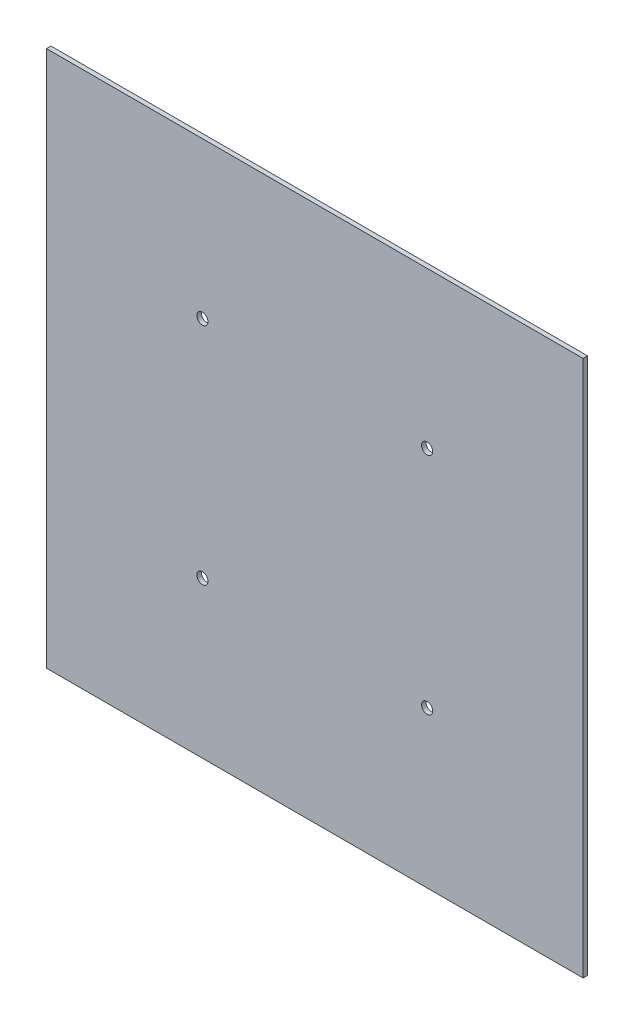
ISO-10303-21;
HEADER;
FILE_DESCRIPTION(('STEP AP214'),'2;1');
FILE_NAME('part.step','',(''),(''),'','','');
FILE_SCHEMA(('AUTOMOTIVE_DESIGN { 1 0 10303 214 1 1 1 1 }'));
ENDSEC;
DATA;
#1=APPLICATION_CONTEXT('core data for automotive mechanical design processes');
#2=APPLICATION_PROTOCOL_DEFINITION('international standard','automotive_design',2000,#1);
#3=PRODUCT_CONTEXT('',#1,'mechanical');
#4=PRODUCT('Part','Part','',(#3));
#5=PRODUCT_RELATED_PRODUCT_CATEGORY('part','',(#4));
#6=PRODUCT_DEFINITION_FORMATION('','',#4);
#7=PRODUCT_DEFINITION_CONTEXT('part definition',#1,'design');
#8=PRODUCT_DEFINITION('design','',#6,#7);
#9=PRODUCT_DEFINITION_SHAPE('','',#8);
#10=(LENGTH_UNIT() NAMED_UNIT(*) SI_UNIT(.MILLI.,.METRE.));
#11=(NAMED_UNIT(*) PLANE_ANGLE_UNIT() SI_UNIT($,.RADIAN.));
#12=(NAMED_UNIT(*) SI_UNIT($,.STERADIAN.) SOLID_ANGLE_UNIT());
#13=UNCERTAINTY_MEASURE_WITH_UNIT(LENGTH_MEASURE(1.E-05),#10,'distance_accuracy_value','');
#14=(GEOMETRIC_REPRESENTATION_CONTEXT(3) GLOBAL_UNCERTAINTY_ASSIGNED_CONTEXT((#13)) GLOBAL_UNIT_ASSIGNED_CONTEXT((#10,
#11,#12)) REPRESENTATION_CONTEXT('',''));
#15=CARTESIAN_POINT('',(0.,0.,0.));
#16=DIRECTION('',(0.,0.,1.));
#17=DIRECTION('',(1.,0.,0.));
#18=AXIS2_PLACEMENT_3D('',#15,#16,#17);
#19=CARTESIAN_POINT('',(0.,0.,2.54));
#20=DIRECTION('',(0.,0.,-1.));
#21=DIRECTION('',(-1.,0.,0.));
#22=AXIS2_PLACEMENT_3D('',#19,#20,#21);
#23=PLANE('',#22);
#24=CARTESIAN_POINT('',(216.225,88.5750000000001,2.54));
#25=DIRECTION('',(0.,0.,1.));
#26=DIRECTION('',(1.,0.,0.));
#27=AXIS2_PLACEMENT_3D('',#24,#25,#26);
#28=CIRCLE('',#27,3.175);
#29=CARTESIAN_POINT('',(219.4,88.5750000000001,2.54));
#30=VERTEX_POINT('',#29);
#31=EDGE_CURVE('E123',#30,#30,#28,.T.);
#32=ORIENTED_EDGE('',*,*,#31,.F.);
#33=EDGE_LOOP('',(#32));
#34=FACE_BOUND('',#33,.T.);
#35=CARTESIAN_POINT('',(88.575,216.225,2.54));
#36=DIRECTION('',(0.,0.,1.));
#37=DIRECTION('',(1.,0.,0.));
#38=AXIS2_PLACEMENT_3D('',#35,#36,#37);
#39=CIRCLE('',#38,3.175);
#40=CARTESIAN_POINT('',(91.75,216.225,2.54));
#41=VERTEX_POINT('',#40);
#42=EDGE_CURVE('E102',#41,#41,#39,.T.);
#43=ORIENTED_EDGE('',*,*,#42,.F.);
#44=EDGE_LOOP('',(#43));
#45=FACE_BOUND('',#44,.T.);
#46=DIRECTION('',(0.,-1.,0.));
#47=VECTOR('',#46,1.);
#48=CARTESIAN_POINT('',(0.,0.,2.54));
#49=LINE('',#48,#47);
#50=CARTESIAN_POINT('',(0.,304.8,2.54));
#51=VERTEX_POINT('',#50);
#52=CARTESIAN_POINT('',(0.,0.,2.54));
#53=VERTEX_POINT('',#52);
#54=EDGE_CURVE('E87',#51,#53,#49,.T.);
#55=ORIENTED_EDGE('',*,*,#54,.T.);
#56=DIRECTION('',(1.,0.,0.));
#57=VECTOR('',#56,1.);
#58=CARTESIAN_POINT('',(0.,0.,2.54));
#59=LINE('',#58,#57);
#60=CARTESIAN_POINT('',(304.8,0.,2.54));
#61=VERTEX_POINT('',#60);
#62=EDGE_CURVE('E82',#53,#61,#59,.T.);
#63=ORIENTED_EDGE('',*,*,#62,.T.);
#64=DIRECTION('',(0.,1.,0.));
#65=VECTOR('',#64,1.);
#66=CARTESIAN_POINT('',(304.8,0.,2.54));
#67=LINE('',#66,#65);
#68=CARTESIAN_POINT('',(304.8,304.8,2.54));
#69=VERTEX_POINT('',#68);
#70=EDGE_CURVE('E85',#61,#69,#67,.T.);
#71=ORIENTED_EDGE('',*,*,#70,.T.);
#72=DIRECTION('',(-1.,0.,0.));
#73=VECTOR('',#72,1.);
#74=CARTESIAN_POINT('',(0.,304.8,2.54));
#75=LINE('',#74,#73);
#76=EDGE_CURVE('E52',#69,#51,#75,.T.);
#77=ORIENTED_EDGE('',*,*,#76,.T.);
#78=EDGE_LOOP('',(#55,#63,#71,#77));
#79=FACE_BOUND('',#78,.T.);
#80=CARTESIAN_POINT('',(88.5750000000001,88.575,2.54));
#81=DIRECTION('',(0.,0.,1.));
#82=DIRECTION('',(-1.,0.,0.));
#83=AXIS2_PLACEMENT_3D('',#80,#81,#82);
#84=CIRCLE('',#83,3.175);
#85=CARTESIAN_POINT('',(85.4000000000001,88.575,2.54));
#86=VERTEX_POINT('',#85);
#87=EDGE_CURVE('E117',#86,#86,#84,.T.);
#88=ORIENTED_EDGE('',*,*,#87,.F.);
#89=EDGE_LOOP('',(#88));
#90=FACE_BOUND('',#89,.T.);
#91=CARTESIAN_POINT('',(216.225,216.225,2.54));
#92=DIRECTION('',(0.,0.,1.));
#93=DIRECTION('',(-1.,0.,0.));
#94=AXIS2_PLACEMENT_3D('',#91,#92,#93);
#95=CIRCLE('',#94,3.175);
#96=CARTESIAN_POINT('',(213.05,216.225,2.54));
#97=VERTEX_POINT('',#96);
#98=EDGE_CURVE('E129',#97,#97,#95,.T.);
#99=ORIENTED_EDGE('',*,*,#98,.F.);
#100=EDGE_LOOP('',(#99));
#101=FACE_BOUND('',#100,.T.);
#102=ADVANCED_FACE('F35',(#34,#45,#79,#90,#101),#23,.F.);
#103=CARTESIAN_POINT('',(0.,0.,0.));
#104=DIRECTION('',(0.,0.,-1.));
#105=DIRECTION('',(-1.,0.,0.));
#106=AXIS2_PLACEMENT_3D('',#103,#104,#105);
#107=PLANE('',#106);
#108=CARTESIAN_POINT('',(216.225,88.5750000000001,0.));
#109=DIRECTION('',(0.,0.,1.));
#110=DIRECTION('',(1.,0.,0.));
#111=AXIS2_PLACEMENT_3D('',#108,#109,#110);
#112=CIRCLE('',#111,3.175);
#113=CARTESIAN_POINT('',(219.4,88.5750000000001,0.));
#114=VERTEX_POINT('',#113);
#115=EDGE_CURVE('E126',#114,#114,#112,.T.);
#116=ORIENTED_EDGE('',*,*,#115,.T.);
#117=EDGE_LOOP('',(#116));
#118=FACE_BOUND('',#117,.T.);
#119=CARTESIAN_POINT('',(88.575,216.225,0.));
#120=DIRECTION('',(0.,0.,1.));
#121=DIRECTION('',(1.,0.,0.));
#122=AXIS2_PLACEMENT_3D('',#119,#120,#121);
#123=CIRCLE('',#122,3.175);
#124=CARTESIAN_POINT('',(91.75,216.225,0.));
#125=VERTEX_POINT('',#124);
#126=EDGE_CURVE('E114',#125,#125,#123,.T.);
#127=ORIENTED_EDGE('',*,*,#126,.T.);
#128=EDGE_LOOP('',(#127));
#129=FACE_BOUND('',#128,.T.);
#130=DIRECTION('',(0.,-1.,0.));
#131=VECTOR('',#130,1.);
#132=CARTESIAN_POINT('',(0.,0.,0.));
#133=LINE('',#132,#131);
#134=CARTESIAN_POINT('',(0.,304.8,0.));
#135=VERTEX_POINT('',#134);
#136=CARTESIAN_POINT('',(0.,0.,0.));
#137=VERTEX_POINT('',#136);
#138=EDGE_CURVE('E99',#135,#137,#133,.T.);
#139=ORIENTED_EDGE('',*,*,#138,.F.);
#140=DIRECTION('',(-1.,0.,0.));
#141=VECTOR('',#140,1.);
#142=CARTESIAN_POINT('',(0.,304.8,0.));
#143=LINE('',#142,#141);
#144=CARTESIAN_POINT('',(304.8,304.8,0.));
#145=VERTEX_POINT('',#144);
#146=EDGE_CURVE('E75',#145,#135,#143,.T.);
#147=ORIENTED_EDGE('',*,*,#146,.F.);
#148=DIRECTION('',(0.,1.,0.));
#149=VECTOR('',#148,1.);
#150=CARTESIAN_POINT('',(304.8,0.,0.));
#151=LINE('',#150,#149);
#152=CARTESIAN_POINT('',(304.8,0.,0.));
#153=VERTEX_POINT('',#152);
#154=EDGE_CURVE('E69',#153,#145,#151,.T.);
#155=ORIENTED_EDGE('',*,*,#154,.F.);
#156=DIRECTION('',(1.,0.,0.));
#157=VECTOR('',#156,1.);
#158=CARTESIAN_POINT('',(0.,0.,0.));
#159=LINE('',#158,#157);
#160=EDGE_CURVE('E91',#137,#153,#159,.T.);
#161=ORIENTED_EDGE('',*,*,#160,.F.);
#162=EDGE_LOOP('',(#139,#147,#155,#161));
#163=FACE_BOUND('',#162,.T.);
#164=CARTESIAN_POINT('',(88.5750000000001,88.575,0.));
#165=DIRECTION('',(0.,0.,1.));
#166=DIRECTION('',(-1.,0.,0.));
#167=AXIS2_PLACEMENT_3D('',#164,#165,#166);
#168=CIRCLE('',#167,3.175);
#169=CARTESIAN_POINT('',(85.4000000000001,88.575,0.));
#170=VERTEX_POINT('',#169);
#171=EDGE_CURVE('E120',#170,#170,#168,.T.);
#172=ORIENTED_EDGE('',*,*,#171,.T.);
#173=EDGE_LOOP('',(#172));
#174=FACE_BOUND('',#173,.T.);
#175=CARTESIAN_POINT('',(216.225,216.225,0.));
#176=DIRECTION('',(0.,0.,1.));
#177=DIRECTION('',(-1.,0.,0.));
#178=AXIS2_PLACEMENT_3D('',#175,#176,#177);
#179=CIRCLE('',#178,3.175);
#180=CARTESIAN_POINT('',(213.05,216.225,0.));
#181=VERTEX_POINT('',#180);
#182=EDGE_CURVE('E132',#181,#181,#179,.T.);
#183=ORIENTED_EDGE('',*,*,#182,.T.);
#184=EDGE_LOOP('',(#183));
#185=FACE_BOUND('',#184,.T.);
#186=ADVANCED_FACE('F110',(#118,#129,#163,#174,#185),#107,.T.);
#187=CARTESIAN_POINT('',(0.,0.,2.54));
#188=DIRECTION('',(1.,0.,0.));
#189=DIRECTION('',(0.,0.,-1.));
#190=AXIS2_PLACEMENT_3D('',#187,#188,#189);
#191=PLANE('',#190);
#192=ORIENTED_EDGE('',*,*,#138,.T.);
#193=DIRECTION('',(0.,0.,-1.));
#194=VECTOR('',#193,1.);
#195=CARTESIAN_POINT('',(0.,0.,2.54));
#196=LINE('',#195,#194);
#197=EDGE_CURVE('E11',#53,#137,#196,.T.);
#198=ORIENTED_EDGE('',*,*,#197,.F.);
#199=ORIENTED_EDGE('',*,*,#54,.F.);
#200=DIRECTION('',(0.,0.,-1.));
#201=VECTOR('',#200,1.);
#202=CARTESIAN_POINT('',(0.,304.8,2.54));
#203=LINE('',#202,#201);
#204=EDGE_CURVE('E95',#51,#135,#203,.T.);
#205=ORIENTED_EDGE('',*,*,#204,.T.);
#206=EDGE_LOOP('',(#192,#198,#199,#205));
#207=FACE_BOUND('',#206,.T.);
#208=ADVANCED_FACE('F37',(#207),#191,.F.);
#209=CARTESIAN_POINT('',(0.,0.,2.54));
#210=DIRECTION('',(0.,1.,0.));
#211=DIRECTION('',(0.,0.,1.));
#212=AXIS2_PLACEMENT_3D('',#209,#210,#211);
#213=PLANE('',#212);
#214=ORIENTED_EDGE('',*,*,#160,.T.);
#215=DIRECTION('',(0.,0.,-1.));
#216=VECTOR('',#215,1.);
#217=CARTESIAN_POINT('',(304.8,0.,2.54));
#218=LINE('',#217,#216);
#219=EDGE_CURVE('E44',#61,#153,#218,.T.);
#220=ORIENTED_EDGE('',*,*,#219,.F.);
#221=ORIENTED_EDGE('',*,*,#62,.F.);
#222=ORIENTED_EDGE('',*,*,#197,.T.);
#223=EDGE_LOOP('',(#214,#220,#221,#222));
#224=FACE_BOUND('',#223,.T.);
#225=ADVANCED_FACE('F90',(#224),#213,.F.);
#226=CARTESIAN_POINT('',(304.8,0.,2.54));
#227=DIRECTION('',(-1.,0.,0.));
#228=DIRECTION('',(0.,0.,1.));
#229=AXIS2_PLACEMENT_3D('',#226,#227,#228);
#230=PLANE('',#229);
#231=ORIENTED_EDGE('',*,*,#154,.T.);
#232=DIRECTION('',(0.,0.,-1.));
#233=VECTOR('',#232,1.);
#234=CARTESIAN_POINT('',(304.8,304.8,2.54));
#235=LINE('',#234,#233);
#236=EDGE_CURVE('E92',#69,#145,#235,.T.);
#237=ORIENTED_EDGE('',*,*,#236,.F.);
#238=ORIENTED_EDGE('',*,*,#70,.F.);
#239=ORIENTED_EDGE('',*,*,#219,.T.);
#240=EDGE_LOOP('',(#231,#237,#238,#239));
#241=FACE_BOUND('',#240,.T.);
#242=ADVANCED_FACE('F93',(#241),#230,.F.);
#243=CARTESIAN_POINT('',(0.,304.8,2.54));
#244=DIRECTION('',(0.,-1.,0.));
#245=DIRECTION('',(0.,0.,-1.));
#246=AXIS2_PLACEMENT_3D('',#243,#244,#245);
#247=PLANE('',#246);
#248=ORIENTED_EDGE('',*,*,#146,.T.);
#249=ORIENTED_EDGE('',*,*,#204,.F.);
#250=ORIENTED_EDGE('',*,*,#76,.F.);
#251=ORIENTED_EDGE('',*,*,#236,.T.);
#252=EDGE_LOOP('',(#248,#249,#250,#251));
#253=FACE_BOUND('',#252,.T.);
#254=ADVANCED_FACE('F107',(#253),#247,.F.);
#255=CARTESIAN_POINT('',(88.575,216.225,2.54));
#256=DIRECTION('',(0.,0.,-1.));
#257=DIRECTION('',(-1.,0.,0.));
#258=AXIS2_PLACEMENT_3D('',#255,#256,#257);
#259=CYLINDRICAL_SURFACE('',#258,3.175);
#260=ORIENTED_EDGE('',*,*,#42,.T.);
#261=EDGE_LOOP('',(#260));
#262=FACE_BOUND('',#261,.T.);
#263=ORIENTED_EDGE('',*,*,#126,.F.);
#264=EDGE_LOOP('',(#263));
#265=FACE_BOUND('',#264,.T.);
#266=ADVANCED_FACE('F152',(#262,#265),#259,.F.);
#267=CARTESIAN_POINT('',(88.5750000000001,88.575,2.54));
#268=DIRECTION('',(0.,0.,-1.));
#269=DIRECTION('',(-1.,0.,0.));
#270=AXIS2_PLACEMENT_3D('',#267,#268,#269);
#271=CYLINDRICAL_SURFACE('',#270,3.175);
#272=ORIENTED_EDGE('',*,*,#87,.T.);
#273=EDGE_LOOP('',(#272));
#274=FACE_BOUND('',#273,.T.);
#275=ORIENTED_EDGE('',*,*,#171,.F.);
#276=EDGE_LOOP('',(#275));
#277=FACE_BOUND('',#276,.T.);
#278=ADVANCED_FACE('F198',(#274,#277),#271,.F.);
#279=CARTESIAN_POINT('',(216.225,88.5750000000001,2.54));
#280=DIRECTION('',(0.,0.,-1.));
#281=DIRECTION('',(-1.,0.,0.));
#282=AXIS2_PLACEMENT_3D('',#279,#280,#281);
#283=CYLINDRICAL_SURFACE('',#282,3.175);
#284=ORIENTED_EDGE('',*,*,#31,.T.);
#285=EDGE_LOOP('',(#284));
#286=FACE_BOUND('',#285,.T.);
#287=ORIENTED_EDGE('',*,*,#115,.F.);
#288=EDGE_LOOP('',(#287));
#289=FACE_BOUND('',#288,.T.);
#290=ADVANCED_FACE('F206',(#286,#289),#283,.F.);
#291=CARTESIAN_POINT('',(216.225,216.225,2.54));
#292=DIRECTION('',(0.,0.,-1.));
#293=DIRECTION('',(-1.,0.,0.));
#294=AXIS2_PLACEMENT_3D('',#291,#292,#293);
#295=CYLINDRICAL_SURFACE('',#294,3.175);
#296=ORIENTED_EDGE('',*,*,#98,.T.);
#297=EDGE_LOOP('',(#296));
#298=FACE_BOUND('',#297,.T.);
#299=ORIENTED_EDGE('',*,*,#182,.F.);
#300=EDGE_LOOP('',(#299));
#301=FACE_BOUND('',#300,.T.);
#302=ADVANCED_FACE('F138',(#298,#301),#295,.F.);
#303=CLOSED_SHELL('',(#102,#186,#208,#225,#242,#254,#266,#278,#290,#302));
#304=MANIFOLD_SOLID_BREP('B2',#303);
#305=ADVANCED_BREP_SHAPE_REPRESENTATION('',(#18,#304),#14);
#306=SHAPE_DEFINITION_REPRESENTATION(#9,#305);
ENDSEC;
END-ISO-10303-21;
